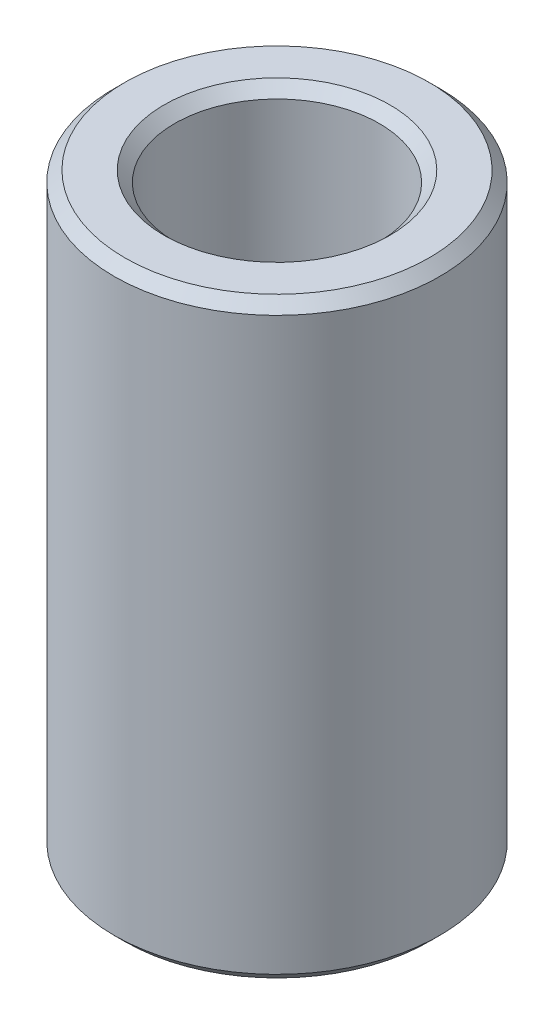
ISO-10303-21;
HEADER;
FILE_DESCRIPTION(('STEP AP214'),'2;1');
FILE_NAME('part.step','',(''),(''),'','','');
FILE_SCHEMA(('AUTOMOTIVE_DESIGN { 1 0 10303 214 1 1 1 1 }'));
ENDSEC;
DATA;
#1=APPLICATION_CONTEXT('core data for automotive mechanical design processes');
#2=APPLICATION_PROTOCOL_DEFINITION('international standard','automotive_design',2000,#1);
#3=PRODUCT_CONTEXT('',#1,'mechanical');
#4=PRODUCT('Part','Part','',(#3));
#5=PRODUCT_RELATED_PRODUCT_CATEGORY('part','',(#4));
#6=PRODUCT_DEFINITION_FORMATION('','',#4);
#7=PRODUCT_DEFINITION_CONTEXT('part definition',#1,'design');
#8=PRODUCT_DEFINITION('design','',#6,#7);
#9=PRODUCT_DEFINITION_SHAPE('','',#8);
#10=(LENGTH_UNIT() NAMED_UNIT(*) SI_UNIT(.MILLI.,.METRE.));
#11=(NAMED_UNIT(*) PLANE_ANGLE_UNIT() SI_UNIT($,.RADIAN.));
#12=(NAMED_UNIT(*) SI_UNIT($,.STERADIAN.) SOLID_ANGLE_UNIT());
#13=UNCERTAINTY_MEASURE_WITH_UNIT(LENGTH_MEASURE(1.E-05),#10,'distance_accuracy_value','');
#14=(GEOMETRIC_REPRESENTATION_CONTEXT(3) GLOBAL_UNCERTAINTY_ASSIGNED_CONTEXT((#13)) GLOBAL_UNIT_ASSIGNED_CONTEXT((#10,
#11,#12)) REPRESENTATION_CONTEXT('',''));
#15=CARTESIAN_POINT('',(0.,0.,0.));
#16=DIRECTION('',(0.,0.,1.));
#17=DIRECTION('',(1.,0.,0.));
#18=AXIS2_PLACEMENT_3D('',#15,#16,#17);
#19=CARTESIAN_POINT('',(0.,127.300378566437,0.));
#20=DIRECTION('',(0.,-1.,0.));
#21=DIRECTION('',(0.,0.,-1.));
#22=AXIS2_PLACEMENT_3D('',#19,#20,#21);
#23=CYLINDRICAL_SURFACE('',#22,35.);
#24=CARTESIAN_POINT('',(0.,2.30233402528626,0.));
#25=DIRECTION('',(0.,1.,0.));
#26=DIRECTION('',(0.,0.,1.));
#27=AXIS2_PLACEMENT_3D('',#24,#25,#26);
#28=CIRCLE('',#27,35.);
#29=CARTESIAN_POINT('',(0.,2.30233402528626,35.));
#30=VERTEX_POINT('',#29);
#31=EDGE_CURVE('E10',#30,#30,#28,.T.);
#32=ORIENTED_EDGE('',*,*,#31,.T.);
#33=EDGE_LOOP('',(#32));
#34=FACE_BOUND('',#33,.T.);
#35=CARTESIAN_POINT('',(0.,124.998044541151,0.));
#36=DIRECTION('',(0.,1.,0.));
#37=DIRECTION('',(0.,0.,1.));
#38=AXIS2_PLACEMENT_3D('',#35,#36,#37);
#39=CIRCLE('',#38,35.);
#40=CARTESIAN_POINT('',(0.,124.998044541151,35.));
#41=VERTEX_POINT('',#40);
#42=EDGE_CURVE('E50',#41,#41,#39,.F.);
#43=ORIENTED_EDGE('',*,*,#42,.T.);
#44=EDGE_LOOP('',(#43));
#45=FACE_BOUND('',#44,.T.);
#46=ADVANCED_FACE('F39',(#34,#45),#23,.T.);
#47=CARTESIAN_POINT('',(0.,127.300378566437,0.));
#48=DIRECTION('',(0.,1.,0.));
#49=DIRECTION('',(0.,0.,1.));
#50=AXIS2_PLACEMENT_3D('',#47,#48,#49);
#51=PLANE('',#50);
#52=CARTESIAN_POINT('',(0.,127.300378566437,0.));
#53=DIRECTION('',(0.,1.,0.));
#54=DIRECTION('',(0.,0.,1.));
#55=AXIS2_PLACEMENT_3D('',#52,#53,#54);
#56=CIRCLE('',#55,24.2947605737518);
#57=CARTESIAN_POINT('',(0.,127.300378566437,24.2947605737518));
#58=VERTEX_POINT('',#57);
#59=EDGE_CURVE('E58',#58,#58,#56,.F.);
#60=ORIENTED_EDGE('',*,*,#59,.T.);
#61=EDGE_LOOP('',(#60));
#62=FACE_BOUND('',#61,.T.);
#63=CARTESIAN_POINT('',(0.,127.300378566437,0.));
#64=DIRECTION('',(0.,1.,0.));
#65=DIRECTION('',(0.,0.,1.));
#66=AXIS2_PLACEMENT_3D('',#63,#64,#65);
#67=CIRCLE('',#66,32.6976659747137);
#68=CARTESIAN_POINT('',(0.,127.300378566437,32.6976659747137));
#69=VERTEX_POINT('',#68);
#70=EDGE_CURVE('E61',#69,#69,#67,.T.);
#71=ORIENTED_EDGE('',*,*,#70,.T.);
#72=EDGE_LOOP('',(#71));
#73=FACE_BOUND('',#72,.T.);
#74=ADVANCED_FACE('F88',(#62,#73),#51,.T.);
#75=CARTESIAN_POINT('',(0.,0.,0.));
#76=DIRECTION('',(0.,1.,0.));
#77=DIRECTION('',(0.,0.,1.));
#78=AXIS2_PLACEMENT_3D('',#75,#76,#77);
#79=PLANE('',#78);
#80=CARTESIAN_POINT('',(0.,0.,0.));
#81=DIRECTION('',(0.,1.,0.));
#82=DIRECTION('',(0.,0.,1.));
#83=AXIS2_PLACEMENT_3D('',#80,#81,#82);
#84=CIRCLE('',#83,24.2947605737518);
#85=CARTESIAN_POINT('',(0.,0.,24.2947605737518));
#86=VERTEX_POINT('',#85);
#87=EDGE_CURVE('E51',#86,#86,#84,.T.);
#88=ORIENTED_EDGE('',*,*,#87,.T.);
#89=EDGE_LOOP('',(#88));
#90=FACE_BOUND('',#89,.T.);
#91=CARTESIAN_POINT('',(0.,0.,0.));
#92=DIRECTION('',(0.,1.,0.));
#93=DIRECTION('',(0.,0.,1.));
#94=AXIS2_PLACEMENT_3D('',#91,#92,#93);
#95=CIRCLE('',#94,32.6976659747137);
#96=CARTESIAN_POINT('',(0.,0.,32.6976659747137));
#97=VERTEX_POINT('',#96);
#98=EDGE_CURVE('E54',#97,#97,#95,.F.);
#99=ORIENTED_EDGE('',*,*,#98,.T.);
#100=EDGE_LOOP('',(#99));
#101=FACE_BOUND('',#100,.T.);
#102=ADVANCED_FACE('F83',(#90,#101),#79,.F.);
#103=CARTESIAN_POINT('',(0.,127.300378566437,0.));
#104=DIRECTION('',(0.,-1.,0.));
#105=DIRECTION('',(0.,0.,-1.));
#106=AXIS2_PLACEMENT_3D('',#103,#104,#105);
#107=CYLINDRICAL_SURFACE('',#106,21.9924265484655);
#108=CARTESIAN_POINT('',(0.,124.998044541151,0.));
#109=DIRECTION('',(0.,1.,0.));
#110=DIRECTION('',(0.,0.,1.));
#111=AXIS2_PLACEMENT_3D('',#108,#109,#110);
#112=CIRCLE('',#111,21.9924265484655);
#113=CARTESIAN_POINT('',(0.,124.998044541151,21.9924265484655));
#114=VERTEX_POINT('',#113);
#115=EDGE_CURVE('E67',#114,#114,#112,.T.);
#116=ORIENTED_EDGE('',*,*,#115,.T.);
#117=EDGE_LOOP('',(#116));
#118=FACE_BOUND('',#117,.T.);
#119=CARTESIAN_POINT('',(0.,2.30233402528626,0.));
#120=DIRECTION('',(0.,1.,0.));
#121=DIRECTION('',(0.,0.,1.));
#122=AXIS2_PLACEMENT_3D('',#119,#120,#121);
#123=CIRCLE('',#122,21.9924265484655);
#124=CARTESIAN_POINT('',(0.,2.30233402528626,21.9924265484655));
#125=VERTEX_POINT('',#124);
#126=EDGE_CURVE('E69',#125,#125,#123,.F.);
#127=ORIENTED_EDGE('',*,*,#126,.T.);
#128=EDGE_LOOP('',(#127));
#129=FACE_BOUND('',#128,.T.);
#130=ADVANCED_FACE('F71',(#118,#129),#107,.F.);
#131=CARTESIAN_POINT('',(0.,124.998044541151,0.));
#132=DIRECTION('',(0.,1.,0.));
#133=DIRECTION('',(0.,0.,1.));
#134=AXIS2_PLACEMENT_3D('',#131,#132,#133);
#135=CONICAL_SURFACE('',#134,21.9924265484655,0.785398163397451);
#136=ORIENTED_EDGE('',*,*,#59,.F.);
#137=EDGE_LOOP('',(#136));
#138=FACE_BOUND('',#137,.T.);
#139=ORIENTED_EDGE('',*,*,#115,.F.);
#140=EDGE_LOOP('',(#139));
#141=FACE_BOUND('',#140,.T.);
#142=ADVANCED_FACE('F77',(#138,#141),#135,.F.);
#143=CARTESIAN_POINT('',(0.,0.,0.));
#144=DIRECTION('',(0.,-1.,0.));
#145=DIRECTION('',(0.,0.,-1.));
#146=AXIS2_PLACEMENT_3D('',#143,#144,#145);
#147=CONICAL_SURFACE('',#146,24.2947605737518,0.785398163397448);
#148=ORIENTED_EDGE('',*,*,#126,.F.);
#149=EDGE_LOOP('',(#148));
#150=FACE_BOUND('',#149,.T.);
#151=ORIENTED_EDGE('',*,*,#87,.F.);
#152=EDGE_LOOP('',(#151));
#153=FACE_BOUND('',#152,.T.);
#154=ADVANCED_FACE('F73',(#150,#153),#147,.F.);
#155=CARTESIAN_POINT('',(0.,2.30233402528626,0.));
#156=DIRECTION('',(0.,1.,0.));
#157=DIRECTION('',(0.,0.,1.));
#158=AXIS2_PLACEMENT_3D('',#155,#156,#157);
#159=CONICAL_SURFACE('',#158,35.,0.78539816339745);
#160=ORIENTED_EDGE('',*,*,#98,.F.);
#161=EDGE_LOOP('',(#160));
#162=FACE_BOUND('',#161,.T.);
#163=ORIENTED_EDGE('',*,*,#31,.F.);
#164=EDGE_LOOP('',(#163));
#165=FACE_BOUND('',#164,.T.);
#166=ADVANCED_FACE('F76',(#162,#165),#159,.T.);
#167=CARTESIAN_POINT('',(0.,127.300378566437,0.));
#168=DIRECTION('',(0.,-1.,0.));
#169=DIRECTION('',(0.,0.,-1.));
#170=AXIS2_PLACEMENT_3D('',#167,#168,#169);
#171=CONICAL_SURFACE('',#170,32.6976659747137,0.785398163397444);
#172=ORIENTED_EDGE('',*,*,#42,.F.);
#173=EDGE_LOOP('',(#172));
#174=FACE_BOUND('',#173,.T.);
#175=ORIENTED_EDGE('',*,*,#70,.F.);
#176=EDGE_LOOP('',(#175));
#177=FACE_BOUND('',#176,.T.);
#178=ADVANCED_FACE('F45',(#174,#177),#171,.T.);
#179=CLOSED_SHELL('',(#46,#74,#102,#130,#142,#154,#166,#178));
#180=MANIFOLD_SOLID_BREP('B2',#179);
#181=ADVANCED_BREP_SHAPE_REPRESENTATION('',(#18,#180),#14);
#182=SHAPE_DEFINITION_REPRESENTATION(#9,#181);
ENDSEC;
END-ISO-10303-21;
